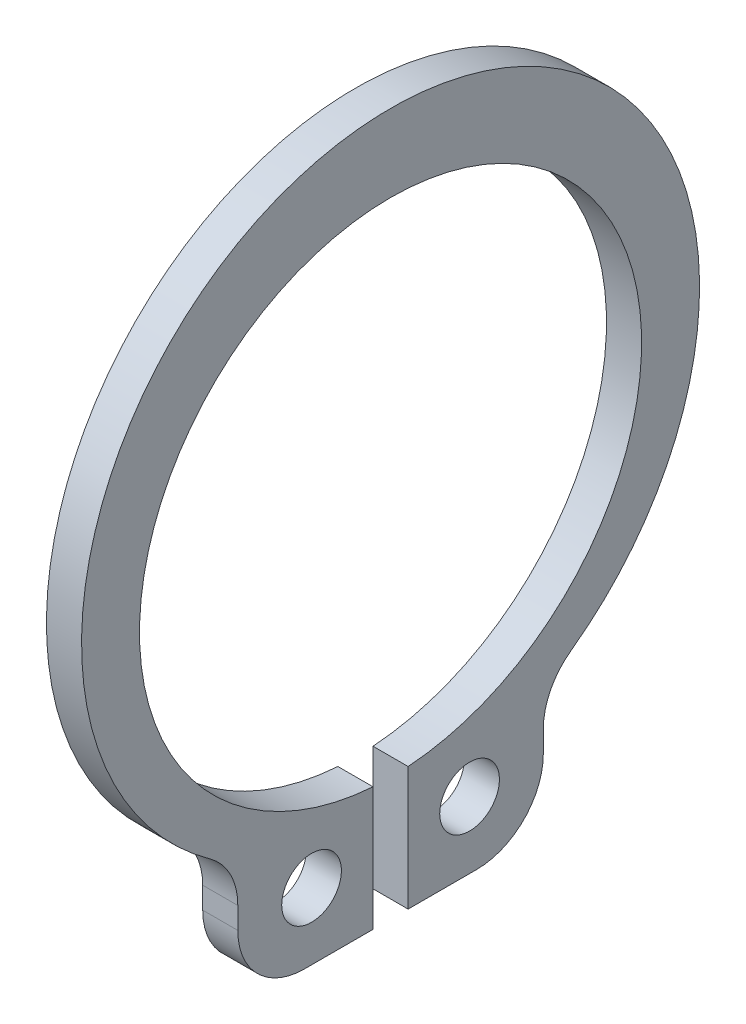
ISO-10303-21;
HEADER;
FILE_DESCRIPTION(('STEP AP214'),'2;1');
FILE_NAME('part.step','',(''),(''),'','','');
FILE_SCHEMA(('AUTOMOTIVE_DESIGN { 1 0 10303 214 1 1 1 1 }'));
ENDSEC;
DATA;
#1=APPLICATION_CONTEXT('core data for automotive mechanical design processes');
#2=APPLICATION_PROTOCOL_DEFINITION('international standard','automotive_design',2000,#1);
#3=PRODUCT_CONTEXT('',#1,'mechanical');
#4=PRODUCT('Part','Part','',(#3));
#5=PRODUCT_RELATED_PRODUCT_CATEGORY('part','',(#4));
#6=PRODUCT_DEFINITION_FORMATION('','',#4);
#7=PRODUCT_DEFINITION_CONTEXT('part definition',#1,'design');
#8=PRODUCT_DEFINITION('design','',#6,#7);
#9=PRODUCT_DEFINITION_SHAPE('','',#8);
#10=(LENGTH_UNIT() NAMED_UNIT(*) SI_UNIT(.MILLI.,.METRE.));
#11=(NAMED_UNIT(*) PLANE_ANGLE_UNIT() SI_UNIT($,.RADIAN.));
#12=(NAMED_UNIT(*) SI_UNIT($,.STERADIAN.) SOLID_ANGLE_UNIT());
#13=UNCERTAINTY_MEASURE_WITH_UNIT(LENGTH_MEASURE(1.E-05),#10,'distance_accuracy_value','');
#14=(GEOMETRIC_REPRESENTATION_CONTEXT(3) GLOBAL_UNCERTAINTY_ASSIGNED_CONTEXT((#13)) GLOBAL_UNIT_ASSIGNED_CONTEXT((#10,
#11,#12)) REPRESENTATION_CONTEXT('',''));
#15=CARTESIAN_POINT('',(0.,0.,0.));
#16=DIRECTION('',(0.,0.,1.));
#17=DIRECTION('',(1.,0.,0.));
#18=AXIS2_PLACEMENT_3D('',#15,#16,#17);
#19=CARTESIAN_POINT('',(9.5,0.,0.));
#20=DIRECTION('',(-1.,0.,0.));
#21=DIRECTION('',(0.,0.,1.));
#22=AXIS2_PLACEMENT_3D('',#19,#20,#21);
#23=PLANE('',#22);
#24=CARTESIAN_POINT('',(9.5,-8.75,-2.25));
#25=DIRECTION('',(-1.,0.,0.));
#26=DIRECTION('',(0.,0.,1.));
#27=AXIS2_PLACEMENT_3D('',#24,#25,#26);
#28=CIRCLE('',#27,0.85);
#29=CARTESIAN_POINT('',(9.5,-8.75,-1.4));
#30=VERTEX_POINT('',#29);
#31=EDGE_CURVE('E170',#30,#30,#28,.F.);
#32=ORIENTED_EDGE('',*,*,#31,.T.);
#33=EDGE_LOOP('',(#32));
#34=FACE_BOUND('',#33,.T.);
#35=CARTESIAN_POINT('',(9.5,-8.75,2.25));
#36=DIRECTION('',(-1.,0.,0.));
#37=DIRECTION('',(0.,0.,1.));
#38=AXIS2_PLACEMENT_3D('',#35,#36,#37);
#39=CIRCLE('',#38,0.85);
#40=CARTESIAN_POINT('',(9.5,-8.75,3.1));
#41=VERTEX_POINT('',#40);
#42=EDGE_CURVE('E173',#41,#41,#39,.F.);
#43=ORIENTED_EDGE('',*,*,#42,.T.);
#44=EDGE_LOOP('',(#43));
#45=FACE_BOUND('',#44,.T.);
#46=DIRECTION('',(0.,1.,0.));
#47=VECTOR('',#46,1.);
#48=CARTESIAN_POINT('',(9.5,-8.75,4.35));
#49=LINE('',#48,#47);
#50=CARTESIAN_POINT('',(9.5,-8.1349006902785,4.35));
#51=VERTEX_POINT('',#50);
#52=CARTESIAN_POINT('',(9.5,-8.75,4.35));
#53=VERTEX_POINT('',#52);
#54=EDGE_CURVE('E126',#51,#53,#49,.F.);
#55=ORIENTED_EDGE('',*,*,#54,.F.);
#56=CARTESIAN_POINT('',(9.5,-8.13490069027851,6.25));
#57=DIRECTION('',(-1.,0.,0.));
#58=DIRECTION('',(0.,0.,1.));
#59=AXIS2_PLACEMENT_3D('',#56,#57,#58);
#60=CIRCLE('',#59,1.9);
#61=CARTESIAN_POINT('',(9.5,-6.59272206303279,5.14018691588784));
#62=VERTEX_POINT('',#61);
#63=EDGE_CURVE('E182',#51,#62,#60,.F.);
#64=ORIENTED_EDGE('',*,*,#63,.T.);
#65=CARTESIAN_POINT('',(9.5,0.550000000000003,0.));
#66=DIRECTION('',(-1.,0.,0.));
#67=DIRECTION('',(0.,0.,1.));
#68=AXIS2_PLACEMENT_3D('',#65,#66,#67);
#69=CIRCLE('',#68,8.8);
#70=CARTESIAN_POINT('',(9.5,-6.59272206303279,-5.14018691588785));
#71=VERTEX_POINT('',#70);
#72=EDGE_CURVE('E179',#71,#62,#69,.F.);
#73=ORIENTED_EDGE('',*,*,#72,.F.);
#74=CARTESIAN_POINT('',(9.5,-8.13490069027851,-6.25000000000001));
#75=DIRECTION('',(-1.,0.,0.));
#76=DIRECTION('',(0.,0.,1.));
#77=AXIS2_PLACEMENT_3D('',#74,#75,#76);
#78=CIRCLE('',#77,1.90000000000001);
#79=CARTESIAN_POINT('',(9.5,-8.13490069027851,-4.35));
#80=VERTEX_POINT('',#79);
#81=EDGE_CURVE('E112',#71,#80,#78,.F.);
#82=ORIENTED_EDGE('',*,*,#81,.T.);
#83=DIRECTION('',(0.,1.,0.));
#84=VECTOR('',#83,1.);
#85=CARTESIAN_POINT('',(9.5,-8.1349006902785,-4.35));
#86=LINE('',#85,#84);
#87=CARTESIAN_POINT('',(9.5,-8.75000000000001,-4.35));
#88=VERTEX_POINT('',#87);
#89=EDGE_CURVE('E109',#88,#80,#86,.T.);
#90=ORIENTED_EDGE('',*,*,#89,.F.);
#91=CARTESIAN_POINT('',(9.5,-8.75000000000001,-2.45));
#92=DIRECTION('',(-1.,0.,0.));
#93=DIRECTION('',(0.,0.,1.));
#94=AXIS2_PLACEMENT_3D('',#91,#92,#93);
#95=CIRCLE('',#94,1.9);
#96=CARTESIAN_POINT('',(9.5,-10.65,-2.45));
#97=VERTEX_POINT('',#96);
#98=EDGE_CURVE('E20',#97,#88,#95,.F.);
#99=ORIENTED_EDGE('',*,*,#98,.F.);
#100=DIRECTION('',(0.,0.,-1.));
#101=VECTOR('',#100,1.);
#102=CARTESIAN_POINT('',(9.5,-10.65,-2.45));
#103=LINE('',#102,#101);
#104=CARTESIAN_POINT('',(9.5,-10.65,-0.5));
#105=VERTEX_POINT('',#104);
#106=EDGE_CURVE('E95',#105,#97,#103,.T.);
#107=ORIENTED_EDGE('',*,*,#106,.F.);
#108=DIRECTION('',(0.,1.,0.));
#109=VECTOR('',#108,1.);
#110=CARTESIAN_POINT('',(9.5,-10.65,-0.5));
#111=LINE('',#110,#109);
#112=CARTESIAN_POINT('',(9.5,-7.13249605678125,-0.5));
#113=VERTEX_POINT('',#112);
#114=EDGE_CURVE('E142',#113,#105,#111,.F.);
#115=ORIENTED_EDGE('',*,*,#114,.F.);
#116=CARTESIAN_POINT('',(9.5,0.,0.));
#117=DIRECTION('',(-1.,0.,0.));
#118=DIRECTION('',(0.,0.,1.));
#119=AXIS2_PLACEMENT_3D('',#116,#117,#118);
#120=CIRCLE('',#119,7.15);
#121=CARTESIAN_POINT('',(9.5,-7.13249605678124,0.500000000000004));
#122=VERTEX_POINT('',#121);
#123=EDGE_CURVE('E139',#113,#122,#120,.F.);
#124=ORIENTED_EDGE('',*,*,#123,.T.);
#125=DIRECTION('',(0.,1.,0.));
#126=VECTOR('',#125,1.);
#127=CARTESIAN_POINT('',(9.5,-7.13249605678124,0.500000000000004));
#128=LINE('',#127,#126);
#129=CARTESIAN_POINT('',(9.5,-10.65,0.500000000000001));
#130=VERTEX_POINT('',#129);
#131=EDGE_CURVE('E137',#130,#122,#128,.T.);
#132=ORIENTED_EDGE('',*,*,#131,.F.);
#133=DIRECTION('',(0.,0.,-1.));
#134=VECTOR('',#133,1.);
#135=CARTESIAN_POINT('',(9.5,-10.65,0.5));
#136=LINE('',#135,#134);
#137=CARTESIAN_POINT('',(9.5,-10.65,2.45));
#138=VERTEX_POINT('',#137);
#139=EDGE_CURVE('E130',#138,#130,#136,.T.);
#140=ORIENTED_EDGE('',*,*,#139,.F.);
#141=CARTESIAN_POINT('',(9.5,-8.75,2.45));
#142=DIRECTION('',(-1.,0.,0.));
#143=DIRECTION('',(0.,0.,1.));
#144=AXIS2_PLACEMENT_3D('',#141,#142,#143);
#145=CIRCLE('',#144,1.9);
#146=EDGE_CURVE('E186',#53,#138,#145,.F.);
#147=ORIENTED_EDGE('',*,*,#146,.F.);
#148=EDGE_LOOP('',(#55,#64,#73,#82,#90,#99,#107,#115,#124,#132,#140,#147));
#149=FACE_BOUND('',#148,.T.);
#150=ADVANCED_FACE('F17',(#34,#45,#149),#23,.T.);
#151=CARTESIAN_POINT('',(9.5,-8.1349006902785,-4.35));
#152=DIRECTION('',(0.,0.,-1.));
#153=DIRECTION('',(-1.,0.,0.));
#154=AXIS2_PLACEMENT_3D('',#151,#152,#153);
#155=PLANE('',#154);
#156=ORIENTED_EDGE('',*,*,#89,.T.);
#157=DIRECTION('',(-1.,0.,0.));
#158=VECTOR('',#157,1.);
#159=CARTESIAN_POINT('',(9.5,-8.13490069027851,-4.35));
#160=LINE('',#159,#158);
#161=CARTESIAN_POINT('',(10.5,-8.13490069027851,-4.35));
#162=VERTEX_POINT('',#161);
#163=EDGE_CURVE('E176',#80,#162,#160,.F.);
#164=ORIENTED_EDGE('',*,*,#163,.T.);
#165=DIRECTION('',(0.,1.,0.));
#166=VECTOR('',#165,1.);
#167=CARTESIAN_POINT('',(10.5,0.,-4.35));
#168=LINE('',#167,#166);
#169=CARTESIAN_POINT('',(10.5,-8.75000000000001,-4.35));
#170=VERTEX_POINT('',#169);
#171=EDGE_CURVE('E120',#162,#170,#168,.F.);
#172=ORIENTED_EDGE('',*,*,#171,.T.);
#173=DIRECTION('',(-1.,0.,0.));
#174=VECTOR('',#173,1.);
#175=CARTESIAN_POINT('',(9.5,-8.75,-4.35));
#176=LINE('',#175,#174);
#177=EDGE_CURVE('E105',#88,#170,#176,.F.);
#178=ORIENTED_EDGE('',*,*,#177,.F.);
#179=EDGE_LOOP('',(#156,#164,#172,#178));
#180=FACE_BOUND('',#179,.T.);
#181=ADVANCED_FACE('F118',(#180),#155,.T.);
#182=CARTESIAN_POINT('',(9.5,-8.75000000000001,-2.45));
#183=DIRECTION('',(-1.,0.,0.));
#184=DIRECTION('',(0.,0.,1.));
#185=AXIS2_PLACEMENT_3D('',#182,#183,#184);
#186=CYLINDRICAL_SURFACE('',#185,1.9);
#187=ORIENTED_EDGE('',*,*,#98,.T.);
#188=ORIENTED_EDGE('',*,*,#177,.T.);
#189=CARTESIAN_POINT('',(10.5,-8.75000000000001,-2.45));
#190=DIRECTION('',(-1.,0.,0.));
#191=DIRECTION('',(0.,0.,1.));
#192=AXIS2_PLACEMENT_3D('',#189,#190,#191);
#193=CIRCLE('',#192,1.9);
#194=CARTESIAN_POINT('',(10.5,-10.65,-2.45));
#195=VERTEX_POINT('',#194);
#196=EDGE_CURVE('E167',#170,#195,#193,.T.);
#197=ORIENTED_EDGE('',*,*,#196,.T.);
#198=DIRECTION('',(1.,0.,0.));
#199=VECTOR('',#198,1.);
#200=CARTESIAN_POINT('',(9.5,-10.65,-2.45));
#201=LINE('',#200,#199);
#202=EDGE_CURVE('E107',#97,#195,#201,.T.);
#203=ORIENTED_EDGE('',*,*,#202,.F.);
#204=EDGE_LOOP('',(#187,#188,#197,#203));
#205=FACE_BOUND('',#204,.T.);
#206=ADVANCED_FACE('F102',(#205),#186,.T.);
#207=CARTESIAN_POINT('',(9.5,-10.65,-2.45));
#208=DIRECTION('',(0.,-1.,0.));
#209=DIRECTION('',(0.,0.,-1.));
#210=AXIS2_PLACEMENT_3D('',#207,#208,#209);
#211=PLANE('',#210);
#212=ORIENTED_EDGE('',*,*,#106,.T.);
#213=ORIENTED_EDGE('',*,*,#202,.T.);
#214=DIRECTION('',(0.,0.,1.));
#215=VECTOR('',#214,1.);
#216=CARTESIAN_POINT('',(10.5,-10.65,0.));
#217=LINE('',#216,#215);
#218=CARTESIAN_POINT('',(10.5,-10.65,-0.5));
#219=VERTEX_POINT('',#218);
#220=EDGE_CURVE('E169',#195,#219,#217,.T.);
#221=ORIENTED_EDGE('',*,*,#220,.T.);
#222=DIRECTION('',(1.,0.,0.));
#223=VECTOR('',#222,1.);
#224=CARTESIAN_POINT('',(9.5,-10.65,-0.5));
#225=LINE('',#224,#223);
#226=EDGE_CURVE('E144',#105,#219,#225,.T.);
#227=ORIENTED_EDGE('',*,*,#226,.F.);
#228=EDGE_LOOP('',(#212,#213,#221,#227));
#229=FACE_BOUND('',#228,.T.);
#230=ADVANCED_FACE('F259',(#229),#211,.T.);
#231=CARTESIAN_POINT('',(9.5,-10.65,-0.5));
#232=DIRECTION('',(0.,0.,1.));
#233=DIRECTION('',(1.,0.,0.));
#234=AXIS2_PLACEMENT_3D('',#231,#232,#233);
#235=PLANE('',#234);
#236=ORIENTED_EDGE('',*,*,#114,.T.);
#237=ORIENTED_EDGE('',*,*,#226,.T.);
#238=DIRECTION('',(0.,1.,0.));
#239=VECTOR('',#238,1.);
#240=CARTESIAN_POINT('',(10.5,0.,-0.5));
#241=LINE('',#240,#239);
#242=CARTESIAN_POINT('',(10.5,-7.13249605678125,-0.5));
#243=VERTEX_POINT('',#242);
#244=EDGE_CURVE('E166',#219,#243,#241,.T.);
#245=ORIENTED_EDGE('',*,*,#244,.T.);
#246=DIRECTION('',(-1.,0.,0.));
#247=VECTOR('',#246,1.);
#248=CARTESIAN_POINT('',(9.5,-7.13249605678125,-0.499999999999999));
#249=LINE('',#248,#247);
#250=EDGE_CURVE('E188',#243,#113,#249,.T.);
#251=ORIENTED_EDGE('',*,*,#250,.T.);
#252=EDGE_LOOP('',(#236,#237,#245,#251));
#253=FACE_BOUND('',#252,.T.);
#254=ADVANCED_FACE('F257',(#253),#235,.T.);
#255=CARTESIAN_POINT('',(9.5,0.,0.));
#256=DIRECTION('',(-1.,0.,0.));
#257=DIRECTION('',(0.,0.,1.));
#258=AXIS2_PLACEMENT_3D('',#255,#256,#257);
#259=CYLINDRICAL_SURFACE('',#258,7.15);
#260=CARTESIAN_POINT('',(10.5,0.,0.));
#261=DIRECTION('',(-1.,0.,0.));
#262=DIRECTION('',(0.,0.,1.));
#263=AXIS2_PLACEMENT_3D('',#260,#261,#262);
#264=CIRCLE('',#263,7.15);
#265=CARTESIAN_POINT('',(10.5,-7.13249605678124,0.500000000000004));
#266=VERTEX_POINT('',#265);
#267=EDGE_CURVE('E163',#243,#266,#264,.F.);
#268=ORIENTED_EDGE('',*,*,#267,.T.);
#269=DIRECTION('',(-1.,0.,0.));
#270=VECTOR('',#269,1.);
#271=CARTESIAN_POINT('',(9.5,-7.13249605678124,0.500000000000004));
#272=LINE('',#271,#270);
#273=EDGE_CURVE('E134',#122,#266,#272,.F.);
#274=ORIENTED_EDGE('',*,*,#273,.F.);
#275=ORIENTED_EDGE('',*,*,#123,.F.);
#276=ORIENTED_EDGE('',*,*,#250,.F.);
#277=EDGE_LOOP('',(#268,#274,#275,#276));
#278=FACE_BOUND('',#277,.T.);
#279=ADVANCED_FACE('F254',(#278),#259,.F.);
#280=CARTESIAN_POINT('',(9.5,-7.13249605678124,0.500000000000004));
#281=DIRECTION('',(0.,0.,-1.));
#282=DIRECTION('',(-1.,0.,0.));
#283=AXIS2_PLACEMENT_3D('',#280,#281,#282);
#284=PLANE('',#283);
#285=ORIENTED_EDGE('',*,*,#131,.T.);
#286=ORIENTED_EDGE('',*,*,#273,.T.);
#287=DIRECTION('',(0.,1.,0.));
#288=VECTOR('',#287,1.);
#289=CARTESIAN_POINT('',(10.5,0.,0.500000000000004));
#290=LINE('',#289,#288);
#291=CARTESIAN_POINT('',(10.5,-10.65,0.500000000000003));
#292=VERTEX_POINT('',#291);
#293=EDGE_CURVE('E165',#266,#292,#290,.F.);
#294=ORIENTED_EDGE('',*,*,#293,.T.);
#295=DIRECTION('',(1.,0.,0.));
#296=VECTOR('',#295,1.);
#297=CARTESIAN_POINT('',(9.5,-10.65,0.5));
#298=LINE('',#297,#296);
#299=EDGE_CURVE('E133',#130,#292,#298,.T.);
#300=ORIENTED_EDGE('',*,*,#299,.F.);
#301=EDGE_LOOP('',(#285,#286,#294,#300));
#302=FACE_BOUND('',#301,.T.);
#303=ADVANCED_FACE('F252',(#302),#284,.T.);
#304=CARTESIAN_POINT('',(9.5,-10.65,0.5));
#305=DIRECTION('',(0.,-1.,0.));
#306=DIRECTION('',(0.,0.,-1.));
#307=AXIS2_PLACEMENT_3D('',#304,#305,#306);
#308=PLANE('',#307);
#309=ORIENTED_EDGE('',*,*,#139,.T.);
#310=ORIENTED_EDGE('',*,*,#299,.T.);
#311=DIRECTION('',(0.,0.,1.));
#312=VECTOR('',#311,1.);
#313=CARTESIAN_POINT('',(10.5,-10.65,0.));
#314=LINE('',#313,#312);
#315=CARTESIAN_POINT('',(10.5,-10.65,2.45));
#316=VERTEX_POINT('',#315);
#317=EDGE_CURVE('E162',#292,#316,#314,.T.);
#318=ORIENTED_EDGE('',*,*,#317,.T.);
#319=DIRECTION('',(-1.,0.,0.));
#320=VECTOR('',#319,1.);
#321=CARTESIAN_POINT('',(9.5,-10.65,2.45));
#322=LINE('',#321,#320);
#323=EDGE_CURVE('E129',#138,#316,#322,.F.);
#324=ORIENTED_EDGE('',*,*,#323,.F.);
#325=EDGE_LOOP('',(#309,#310,#318,#324));
#326=FACE_BOUND('',#325,.T.);
#327=ADVANCED_FACE('F246',(#326),#308,.T.);
#328=CARTESIAN_POINT('',(9.5,-8.75,2.45));
#329=DIRECTION('',(-1.,0.,0.));
#330=DIRECTION('',(0.,0.,1.));
#331=AXIS2_PLACEMENT_3D('',#328,#329,#330);
#332=CYLINDRICAL_SURFACE('',#331,1.9);
#333=ORIENTED_EDGE('',*,*,#146,.T.);
#334=ORIENTED_EDGE('',*,*,#323,.T.);
#335=CARTESIAN_POINT('',(10.5,-8.75,2.45));
#336=DIRECTION('',(-1.,0.,0.));
#337=DIRECTION('',(0.,0.,1.));
#338=AXIS2_PLACEMENT_3D('',#335,#336,#337);
#339=CIRCLE('',#338,1.9);
#340=CARTESIAN_POINT('',(10.5,-8.75,4.35));
#341=VERTEX_POINT('',#340);
#342=EDGE_CURVE('E159',#316,#341,#339,.T.);
#343=ORIENTED_EDGE('',*,*,#342,.T.);
#344=DIRECTION('',(1.,0.,0.));
#345=VECTOR('',#344,1.);
#346=CARTESIAN_POINT('',(9.5,-8.75,4.35));
#347=LINE('',#346,#345);
#348=EDGE_CURVE('E128',#53,#341,#347,.T.);
#349=ORIENTED_EDGE('',*,*,#348,.F.);
#350=EDGE_LOOP('',(#333,#334,#343,#349));
#351=FACE_BOUND('',#350,.T.);
#352=ADVANCED_FACE('F241',(#351),#332,.T.);
#353=CARTESIAN_POINT('',(9.5,-8.75,4.35));
#354=DIRECTION('',(0.,0.,1.));
#355=DIRECTION('',(1.,0.,0.));
#356=AXIS2_PLACEMENT_3D('',#353,#354,#355);
#357=PLANE('',#356);
#358=ORIENTED_EDGE('',*,*,#54,.T.);
#359=ORIENTED_EDGE('',*,*,#348,.T.);
#360=DIRECTION('',(0.,1.,0.));
#361=VECTOR('',#360,1.);
#362=CARTESIAN_POINT('',(10.5,0.,4.35));
#363=LINE('',#362,#361);
#364=CARTESIAN_POINT('',(10.5,-8.1349006902785,4.35));
#365=VERTEX_POINT('',#364);
#366=EDGE_CURVE('E158',#341,#365,#363,.T.);
#367=ORIENTED_EDGE('',*,*,#366,.T.);
#368=DIRECTION('',(-1.,0.,0.));
#369=VECTOR('',#368,1.);
#370=CARTESIAN_POINT('',(9.5,-8.1349006902785,4.35));
#371=LINE('',#370,#369);
#372=EDGE_CURVE('E185',#365,#51,#371,.T.);
#373=ORIENTED_EDGE('',*,*,#372,.T.);
#374=EDGE_LOOP('',(#358,#359,#367,#373));
#375=FACE_BOUND('',#374,.T.);
#376=ADVANCED_FACE('F232',(#375),#357,.T.);
#377=CARTESIAN_POINT('',(9.5,-8.13490069027851,6.25));
#378=DIRECTION('',(-1.,0.,0.));
#379=DIRECTION('',(0.,0.,1.));
#380=AXIS2_PLACEMENT_3D('',#377,#378,#379);
#381=CYLINDRICAL_SURFACE('',#380,1.9);
#382=DIRECTION('',(-1.,0.,0.));
#383=VECTOR('',#382,1.);
#384=CARTESIAN_POINT('',(9.5,-6.59272206303279,5.14018691588784));
#385=LINE('',#384,#383);
#386=CARTESIAN_POINT('',(10.5,-6.59272206303279,5.14018691588784));
#387=VERTEX_POINT('',#386);
#388=EDGE_CURVE('E181',#62,#387,#385,.F.);
#389=ORIENTED_EDGE('',*,*,#388,.F.);
#390=ORIENTED_EDGE('',*,*,#63,.F.);
#391=ORIENTED_EDGE('',*,*,#372,.F.);
#392=CARTESIAN_POINT('',(10.5,-8.13490069027851,6.25));
#393=DIRECTION('',(-1.,0.,0.));
#394=DIRECTION('',(0.,0.,1.));
#395=AXIS2_PLACEMENT_3D('',#392,#393,#394);
#396=CIRCLE('',#395,1.9);
#397=EDGE_CURVE('E155',#365,#387,#396,.F.);
#398=ORIENTED_EDGE('',*,*,#397,.T.);
#399=EDGE_LOOP('',(#389,#390,#391,#398));
#400=FACE_BOUND('',#399,.T.);
#401=ADVANCED_FACE('F266',(#400),#381,.F.);
#402=CARTESIAN_POINT('',(9.5,0.550000000000003,0.));
#403=DIRECTION('',(-1.,0.,0.));
#404=DIRECTION('',(0.,0.,1.));
#405=AXIS2_PLACEMENT_3D('',#402,#403,#404);
#406=CYLINDRICAL_SURFACE('',#405,8.8);
#407=DIRECTION('',(-1.,0.,0.));
#408=VECTOR('',#407,1.);
#409=CARTESIAN_POINT('',(9.5,-6.59272206303279,-5.14018691588785));
#410=LINE('',#409,#408);
#411=CARTESIAN_POINT('',(10.5,-6.59272206303279,-5.14018691588785));
#412=VERTEX_POINT('',#411);
#413=EDGE_CURVE('E178',#412,#71,#410,.T.);
#414=ORIENTED_EDGE('',*,*,#413,.T.);
#415=ORIENTED_EDGE('',*,*,#72,.T.);
#416=ORIENTED_EDGE('',*,*,#388,.T.);
#417=CARTESIAN_POINT('',(10.5,0.550000000000003,0.));
#418=DIRECTION('',(-1.,0.,0.));
#419=DIRECTION('',(0.,0.,1.));
#420=AXIS2_PLACEMENT_3D('',#417,#418,#419);
#421=CIRCLE('',#420,8.8);
#422=EDGE_CURVE('E35',#387,#412,#421,.T.);
#423=ORIENTED_EDGE('',*,*,#422,.T.);
#424=EDGE_LOOP('',(#414,#415,#416,#423));
#425=FACE_BOUND('',#424,.T.);
#426=ADVANCED_FACE('F262',(#425),#406,.T.);
#427=CARTESIAN_POINT('',(9.5,-8.13490069027851,-6.25000000000001));
#428=DIRECTION('',(-1.,0.,0.));
#429=DIRECTION('',(0.,0.,1.));
#430=AXIS2_PLACEMENT_3D('',#427,#428,#429);
#431=CYLINDRICAL_SURFACE('',#430,1.90000000000001);
#432=ORIENTED_EDGE('',*,*,#163,.F.);
#433=ORIENTED_EDGE('',*,*,#81,.F.);
#434=ORIENTED_EDGE('',*,*,#413,.F.);
#435=CARTESIAN_POINT('',(10.5,-8.13490069027851,-6.25000000000001));
#436=DIRECTION('',(-1.,0.,0.));
#437=DIRECTION('',(0.,0.,1.));
#438=AXIS2_PLACEMENT_3D('',#435,#436,#437);
#439=CIRCLE('',#438,1.90000000000001);
#440=EDGE_CURVE('E151',#412,#162,#439,.F.);
#441=ORIENTED_EDGE('',*,*,#440,.T.);
#442=EDGE_LOOP('',(#432,#433,#434,#441));
#443=FACE_BOUND('',#442,.T.);
#444=ADVANCED_FACE('F261',(#443),#431,.F.);
#445=CARTESIAN_POINT('',(9.5,-8.75,2.25));
#446=DIRECTION('',(-1.,0.,0.));
#447=DIRECTION('',(0.,0.,1.));
#448=AXIS2_PLACEMENT_3D('',#445,#446,#447);
#449=CYLINDRICAL_SURFACE('',#448,0.85);
#450=CARTESIAN_POINT('',(10.5,-8.75,2.25));
#451=DIRECTION('',(-1.,0.,0.));
#452=DIRECTION('',(0.,0.,1.));
#453=AXIS2_PLACEMENT_3D('',#450,#451,#452);
#454=CIRCLE('',#453,0.85);
#455=CARTESIAN_POINT('',(10.5,-8.75,3.1));
#456=VERTEX_POINT('',#455);
#457=EDGE_CURVE('E26',#456,#456,#454,.F.);
#458=ORIENTED_EDGE('',*,*,#457,.T.);
#459=EDGE_LOOP('',(#458));
#460=FACE_BOUND('',#459,.T.);
#461=ORIENTED_EDGE('',*,*,#42,.F.);
#462=EDGE_LOOP('',(#461));
#463=FACE_BOUND('',#462,.T.);
#464=ADVANCED_FACE('F283',(#460,#463),#449,.F.);
#465=CARTESIAN_POINT('',(9.5,-8.75,-2.25));
#466=DIRECTION('',(-1.,0.,0.));
#467=DIRECTION('',(0.,0.,1.));
#468=AXIS2_PLACEMENT_3D('',#465,#466,#467);
#469=CYLINDRICAL_SURFACE('',#468,0.85);
#470=CARTESIAN_POINT('',(10.5,-8.75,-2.25));
#471=DIRECTION('',(-1.,0.,0.));
#472=DIRECTION('',(0.,0.,1.));
#473=AXIS2_PLACEMENT_3D('',#470,#471,#472);
#474=CIRCLE('',#473,0.85);
#475=CARTESIAN_POINT('',(10.5,-8.75,-1.4));
#476=VERTEX_POINT('',#475);
#477=EDGE_CURVE('E11',#476,#476,#474,.F.);
#478=ORIENTED_EDGE('',*,*,#477,.T.);
#479=EDGE_LOOP('',(#478));
#480=FACE_BOUND('',#479,.T.);
#481=ORIENTED_EDGE('',*,*,#31,.F.);
#482=EDGE_LOOP('',(#481));
#483=FACE_BOUND('',#482,.T.);
#484=ADVANCED_FACE('F277',(#480,#483),#469,.F.);
#485=CARTESIAN_POINT('',(10.5,0.,0.));
#486=DIRECTION('',(-1.,0.,0.));
#487=DIRECTION('',(0.,0.,1.));
#488=AXIS2_PLACEMENT_3D('',#485,#486,#487);
#489=PLANE('',#488);
#490=ORIENTED_EDGE('',*,*,#477,.F.);
#491=EDGE_LOOP('',(#490));
#492=FACE_BOUND('',#491,.T.);
#493=ORIENTED_EDGE('',*,*,#457,.F.);
#494=EDGE_LOOP('',(#493));
#495=FACE_BOUND('',#494,.T.);
#496=ORIENTED_EDGE('',*,*,#440,.F.);
#497=ORIENTED_EDGE('',*,*,#422,.F.);
#498=ORIENTED_EDGE('',*,*,#397,.F.);
#499=ORIENTED_EDGE('',*,*,#366,.F.);
#500=ORIENTED_EDGE('',*,*,#342,.F.);
#501=ORIENTED_EDGE('',*,*,#317,.F.);
#502=ORIENTED_EDGE('',*,*,#293,.F.);
#503=ORIENTED_EDGE('',*,*,#267,.F.);
#504=ORIENTED_EDGE('',*,*,#244,.F.);
#505=ORIENTED_EDGE('',*,*,#220,.F.);
#506=ORIENTED_EDGE('',*,*,#196,.F.);
#507=ORIENTED_EDGE('',*,*,#171,.F.);
#508=EDGE_LOOP('',(#496,#497,#498,#499,#500,#501,#502,#503,#504,#505,#506,#507));
#509=FACE_BOUND('',#508,.T.);
#510=ADVANCED_FACE('F238',(#492,#495,#509),#489,.F.);
#511=CLOSED_SHELL('',(#150,#181,#206,#230,#254,#279,#303,#327,#352,#376,#401,#426,#444,#464,
#484,#510));
#512=MANIFOLD_SOLID_BREP('B1',#511);
#513=ADVANCED_BREP_SHAPE_REPRESENTATION('',(#18,#512),#14);
#514=SHAPE_DEFINITION_REPRESENTATION(#9,#513);
ENDSEC;
END-ISO-10303-21;
